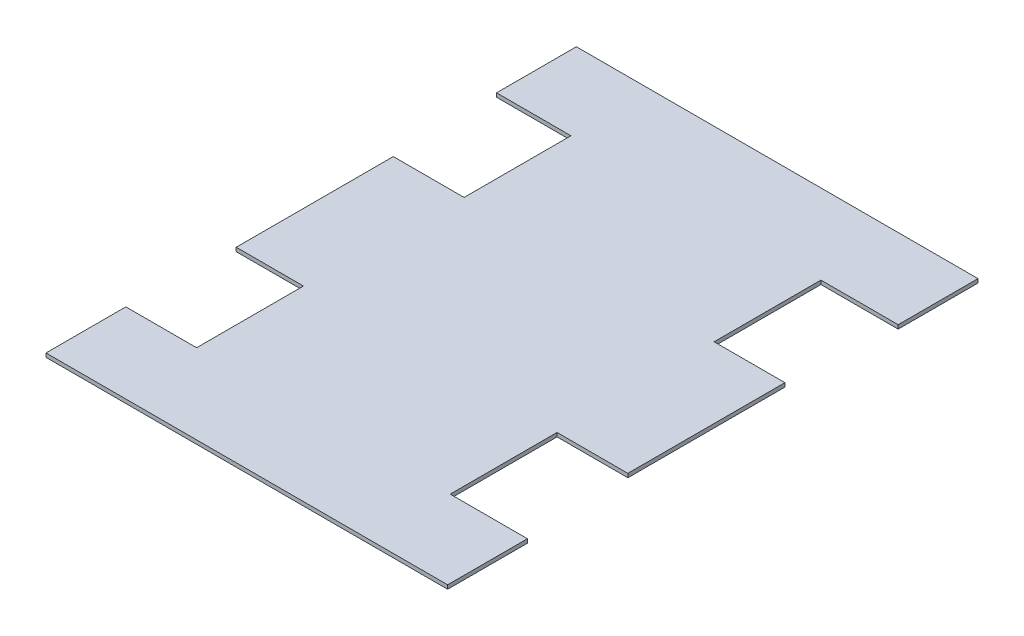
ISO-10303-21;
HEADER;
FILE_DESCRIPTION(('STEP AP214'),'2;1');
FILE_NAME('part.step','',(''),(''),'','','');
FILE_SCHEMA(('AUTOMOTIVE_DESIGN { 1 0 10303 214 1 1 1 1 }'));
ENDSEC;
DATA;
#1=APPLICATION_CONTEXT('core data for automotive mechanical design processes');
#2=APPLICATION_PROTOCOL_DEFINITION('international standard','automotive_design',2000,#1);
#3=PRODUCT_CONTEXT('',#1,'mechanical');
#4=PRODUCT('Part','Part','',(#3));
#5=PRODUCT_RELATED_PRODUCT_CATEGORY('part','',(#4));
#6=PRODUCT_DEFINITION_FORMATION('','',#4);
#7=PRODUCT_DEFINITION_CONTEXT('part definition',#1,'design');
#8=PRODUCT_DEFINITION('design','',#6,#7);
#9=PRODUCT_DEFINITION_SHAPE('','',#8);
#10=(LENGTH_UNIT() NAMED_UNIT(*) SI_UNIT(.MILLI.,.METRE.));
#11=(NAMED_UNIT(*) PLANE_ANGLE_UNIT() SI_UNIT($,.RADIAN.));
#12=(NAMED_UNIT(*) SI_UNIT($,.STERADIAN.) SOLID_ANGLE_UNIT());
#13=UNCERTAINTY_MEASURE_WITH_UNIT(LENGTH_MEASURE(1.E-05),#10,'distance_accuracy_value','');
#14=(GEOMETRIC_REPRESENTATION_CONTEXT(3) GLOBAL_UNCERTAINTY_ASSIGNED_CONTEXT((#13)) GLOBAL_UNIT_ASSIGNED_CONTEXT((#10,
#11,#12)) REPRESENTATION_CONTEXT('',''));
#15=CARTESIAN_POINT('',(0.,0.,0.));
#16=DIRECTION('',(0.,0.,1.));
#17=DIRECTION('',(1.,0.,0.));
#18=AXIS2_PLACEMENT_3D('',#15,#16,#17);
#19=CARTESIAN_POINT('',(-27.0247369323161,3.,-144.778970111384));
#20=DIRECTION('',(0.,0.,-1.));
#21=DIRECTION('',(-1.,0.,0.));
#22=AXIS2_PLACEMENT_3D('',#19,#20,#21);
#23=PLANE('',#22);
#24=DIRECTION('',(1.,0.,0.));
#25=VECTOR('',#24,1.);
#26=CARTESIAN_POINT('',(-27.0247369323161,0.,-144.778970111384));
#27=LINE('',#26,#25);
#28=CARTESIAN_POINT('',(-27.0247369323161,0.,-144.778970111384));
#29=VERTEX_POINT('',#28);
#30=CARTESIAN_POINT('',(30.7568580000845,0.,-144.778970111384));
#31=VERTEX_POINT('',#30);
#32=EDGE_CURVE('E200',#29,#31,#27,.T.);
#33=ORIENTED_EDGE('',*,*,#32,.T.);
#34=DIRECTION('',(0.,-1.,0.));
#35=VECTOR('',#34,1.);
#36=CARTESIAN_POINT('',(30.7568580000845,3.,-144.778970111384));
#37=LINE('',#36,#35);
#38=CARTESIAN_POINT('',(30.7568580000845,3.,-144.778970111384));
#39=VERTEX_POINT('',#38);
#40=EDGE_CURVE('E11',#39,#31,#37,.T.);
#41=ORIENTED_EDGE('',*,*,#40,.F.);
#42=DIRECTION('',(1.,0.,0.));
#43=VECTOR('',#42,1.);
#44=CARTESIAN_POINT('',(-27.0247369323161,3.,-144.778970111384));
#45=LINE('',#44,#43);
#46=CARTESIAN_POINT('',(-27.0247369323161,3.,-144.778970111384));
#47=VERTEX_POINT('',#46);
#48=EDGE_CURVE('E238',#47,#39,#45,.T.);
#49=ORIENTED_EDGE('',*,*,#48,.F.);
#50=DIRECTION('',(0.,-1.,0.));
#51=VECTOR('',#50,1.);
#52=CARTESIAN_POINT('',(-27.0247369323161,3.,-144.778970111384));
#53=LINE('',#52,#51);
#54=EDGE_CURVE('E196',#47,#29,#53,.T.);
#55=ORIENTED_EDGE('',*,*,#54,.T.);
#56=EDGE_LOOP('',(#33,#41,#49,#55));
#57=FACE_BOUND('',#56,.T.);
#58=ADVANCED_FACE('F32',(#57),#23,.F.);
#59=CARTESIAN_POINT('',(30.756858000085,3.,-61.778970111384));
#60=DIRECTION('',(1.,0.,0.));
#61=DIRECTION('',(0.,0.,-1.));
#62=AXIS2_PLACEMENT_3D('',#59,#60,#61);
#63=PLANE('',#62);
#64=DIRECTION('',(0.,0.,1.));
#65=VECTOR('',#64,1.);
#66=CARTESIAN_POINT('',(30.756858000085,0.,-61.778970111384));
#67=LINE('',#66,#65);
#68=CARTESIAN_POINT('',(30.756858000085,0.,-61.778970111384));
#69=VERTEX_POINT('',#68);
#70=EDGE_CURVE('E203',#31,#69,#67,.T.);
#71=ORIENTED_EDGE('',*,*,#70,.T.);
#72=DIRECTION('',(0.,-1.,0.));
#73=VECTOR('',#72,1.);
#74=CARTESIAN_POINT('',(30.756858000085,3.,-61.778970111384));
#75=LINE('',#74,#73);
#76=CARTESIAN_POINT('',(30.756858000085,3.,-61.778970111384));
#77=VERTEX_POINT('',#76);
#78=EDGE_CURVE('E40',#77,#69,#75,.T.);
#79=ORIENTED_EDGE('',*,*,#78,.F.);
#80=DIRECTION('',(0.,0.,1.));
#81=VECTOR('',#80,1.);
#82=CARTESIAN_POINT('',(30.756858000085,3.,-61.778970111384));
#83=LINE('',#82,#81);
#84=EDGE_CURVE('E127',#39,#77,#83,.T.);
#85=ORIENTED_EDGE('',*,*,#84,.F.);
#86=ORIENTED_EDGE('',*,*,#40,.T.);
#87=EDGE_LOOP('',(#71,#79,#85,#86));
#88=FACE_BOUND('',#87,.T.);
#89=ADVANCED_FACE('F356',(#88),#63,.F.);
#90=CARTESIAN_POINT('',(-24.243141999915,3.,-61.7789701113836));
#91=DIRECTION('',(0.,0.,1.));
#92=DIRECTION('',(1.,0.,0.));
#93=AXIS2_PLACEMENT_3D('',#90,#91,#92);
#94=PLANE('',#93);
#95=DIRECTION('',(-1.,0.,0.));
#96=VECTOR('',#95,1.);
#97=CARTESIAN_POINT('',(-24.243141999915,0.,-61.7789701113836));
#98=LINE('',#97,#96);
#99=CARTESIAN_POINT('',(-24.243141999915,0.,-61.7789701113836));
#100=VERTEX_POINT('',#99);
#101=EDGE_CURVE('E205',#69,#100,#98,.T.);
#102=ORIENTED_EDGE('',*,*,#101,.T.);
#103=DIRECTION('',(0.,-1.,0.));
#104=VECTOR('',#103,1.);
#105=CARTESIAN_POINT('',(-24.243141999915,3.,-61.7789701113836));
#106=LINE('',#105,#104);
#107=CARTESIAN_POINT('',(-24.243141999915,3.,-61.7789701113836));
#108=VERTEX_POINT('',#107);
#109=EDGE_CURVE('E281',#108,#100,#106,.T.);
#110=ORIENTED_EDGE('',*,*,#109,.F.);
#111=DIRECTION('',(-1.,0.,0.));
#112=VECTOR('',#111,1.);
#113=CARTESIAN_POINT('',(-24.243141999915,3.,-61.7789701113836));
#114=LINE('',#113,#112);
#115=EDGE_CURVE('E289',#77,#108,#114,.T.);
#116=ORIENTED_EDGE('',*,*,#115,.F.);
#117=ORIENTED_EDGE('',*,*,#78,.T.);
#118=EDGE_LOOP('',(#102,#110,#116,#117));
#119=FACE_BOUND('',#118,.T.);
#120=ADVANCED_FACE('F287',(#119),#94,.F.);
#121=CARTESIAN_POINT('',(-24.2431419999141,3.,60.2210298886164));
#122=DIRECTION('',(1.,0.,0.));
#123=DIRECTION('',(0.,0.,-1.));
#124=AXIS2_PLACEMENT_3D('',#121,#122,#123);
#125=PLANE('',#124);
#126=DIRECTION('',(0.,0.,1.));
#127=VECTOR('',#126,1.);
#128=CARTESIAN_POINT('',(-24.2431419999141,0.,60.2210298886164));
#129=LINE('',#128,#127);
#130=CARTESIAN_POINT('',(-24.2431419999141,0.,60.2210298886164));
#131=VERTEX_POINT('',#130);
#132=EDGE_CURVE('E207',#100,#131,#129,.T.);
#133=ORIENTED_EDGE('',*,*,#132,.T.);
#134=DIRECTION('',(0.,-1.,0.));
#135=VECTOR('',#134,1.);
#136=CARTESIAN_POINT('',(-24.2431419999141,3.,60.2210298886164));
#137=LINE('',#136,#135);
#138=CARTESIAN_POINT('',(-24.2431419999141,3.,60.2210298886164));
#139=VERTEX_POINT('',#138);
#140=EDGE_CURVE('E278',#139,#131,#137,.T.);
#141=ORIENTED_EDGE('',*,*,#140,.F.);
#142=DIRECTION('',(0.,0.,1.));
#143=VECTOR('',#142,1.);
#144=CARTESIAN_POINT('',(-24.2431419999141,3.,60.2210298886164));
#145=LINE('',#144,#143);
#146=EDGE_CURVE('E307',#108,#139,#145,.T.);
#147=ORIENTED_EDGE('',*,*,#146,.F.);
#148=ORIENTED_EDGE('',*,*,#109,.T.);
#149=EDGE_LOOP('',(#133,#141,#147,#148));
#150=FACE_BOUND('',#149,.T.);
#151=ADVANCED_FACE('F298',(#150),#125,.F.);
#152=CARTESIAN_POINT('',(-24.2431419999141,3.,60.2210298886164));
#153=DIRECTION('',(0.,0.,-1.));
#154=DIRECTION('',(-1.,0.,0.));
#155=AXIS2_PLACEMENT_3D('',#152,#153,#154);
#156=PLANE('',#155);
#157=DIRECTION('',(1.,0.,0.));
#158=VECTOR('',#157,1.);
#159=CARTESIAN_POINT('',(-24.2431419999141,0.,60.2210298886164));
#160=LINE('',#159,#158);
#161=CARTESIAN_POINT('',(27.9752630676854,0.,60.221029888616));
#162=VERTEX_POINT('',#161);
#163=EDGE_CURVE('E209',#131,#162,#160,.T.);
#164=ORIENTED_EDGE('',*,*,#163,.T.);
#165=DIRECTION('',(0.,-1.,0.));
#166=VECTOR('',#165,1.);
#167=CARTESIAN_POINT('',(27.9752630676854,3.,60.221029888616));
#168=LINE('',#167,#166);
#169=CARTESIAN_POINT('',(27.9752630676854,3.,60.221029888616));
#170=VERTEX_POINT('',#169);
#171=EDGE_CURVE('E275',#170,#162,#168,.T.);
#172=ORIENTED_EDGE('',*,*,#171,.F.);
#173=DIRECTION('',(1.,0.,0.));
#174=VECTOR('',#173,1.);
#175=CARTESIAN_POINT('',(-24.2431419999141,3.,60.2210298886164));
#176=LINE('',#175,#174);
#177=EDGE_CURVE('E304',#139,#170,#176,.T.);
#178=ORIENTED_EDGE('',*,*,#177,.F.);
#179=ORIENTED_EDGE('',*,*,#140,.T.);
#180=EDGE_LOOP('',(#164,#172,#178,#179));
#181=FACE_BOUND('',#180,.T.);
#182=ADVANCED_FACE('F302',(#181),#156,.F.);
#183=CARTESIAN_POINT('',(27.9752630676859,3.,143.221029888616));
#184=DIRECTION('',(1.,0.,0.));
#185=DIRECTION('',(0.,0.,-1.));
#186=AXIS2_PLACEMENT_3D('',#183,#184,#185);
#187=PLANE('',#186);
#188=DIRECTION('',(0.,0.,1.));
#189=VECTOR('',#188,1.);
#190=CARTESIAN_POINT('',(27.9752630676859,0.,143.221029888616));
#191=LINE('',#190,#189);
#192=CARTESIAN_POINT('',(27.9752630676859,0.,143.221029888616));
#193=VERTEX_POINT('',#192);
#194=EDGE_CURVE('E211',#162,#193,#191,.T.);
#195=ORIENTED_EDGE('',*,*,#194,.T.);
#196=DIRECTION('',(0.,-1.,0.));
#197=VECTOR('',#196,1.);
#198=CARTESIAN_POINT('',(27.9752630676859,3.,143.221029888616));
#199=LINE('',#198,#197);
#200=CARTESIAN_POINT('',(27.9752630676859,3.,143.221029888616));
#201=VERTEX_POINT('',#200);
#202=EDGE_CURVE('E272',#201,#193,#199,.T.);
#203=ORIENTED_EDGE('',*,*,#202,.F.);
#204=DIRECTION('',(0.,0.,1.));
#205=VECTOR('',#204,1.);
#206=CARTESIAN_POINT('',(27.9752630676859,3.,143.221029888616));
#207=LINE('',#206,#205);
#208=EDGE_CURVE('E306',#170,#201,#207,.T.);
#209=ORIENTED_EDGE('',*,*,#208,.F.);
#210=ORIENTED_EDGE('',*,*,#171,.T.);
#211=EDGE_LOOP('',(#195,#203,#209,#210));
#212=FACE_BOUND('',#211,.T.);
#213=ADVANCED_FACE('F369',(#212),#187,.F.);
#214=CARTESIAN_POINT('',(-27.0247369323141,3.,143.221029888616));
#215=DIRECTION('',(0.,0.,1.));
#216=DIRECTION('',(1.,0.,0.));
#217=AXIS2_PLACEMENT_3D('',#214,#215,#216);
#218=PLANE('',#217);
#219=DIRECTION('',(-1.,0.,0.));
#220=VECTOR('',#219,1.);
#221=CARTESIAN_POINT('',(-27.0247369323141,0.,143.221029888616));
#222=LINE('',#221,#220);
#223=CARTESIAN_POINT('',(-27.0247369323141,0.,143.221029888616));
#224=VERTEX_POINT('',#223);
#225=EDGE_CURVE('E213',#193,#224,#222,.T.);
#226=ORIENTED_EDGE('',*,*,#225,.T.);
#227=DIRECTION('',(0.,-1.,0.));
#228=VECTOR('',#227,1.);
#229=CARTESIAN_POINT('',(-27.0247369323141,3.,143.221029888616));
#230=LINE('',#229,#228);
#231=CARTESIAN_POINT('',(-27.0247369323141,3.,143.221029888616));
#232=VERTEX_POINT('',#231);
#233=EDGE_CURVE('E269',#232,#224,#230,.T.);
#234=ORIENTED_EDGE('',*,*,#233,.F.);
#235=DIRECTION('',(-1.,0.,0.));
#236=VECTOR('',#235,1.);
#237=CARTESIAN_POINT('',(-27.0247369323141,3.,143.221029888616));
#238=LINE('',#237,#236);
#239=EDGE_CURVE('E309',#201,#232,#238,.T.);
#240=ORIENTED_EDGE('',*,*,#239,.F.);
#241=ORIENTED_EDGE('',*,*,#202,.T.);
#242=EDGE_LOOP('',(#226,#234,#240,#241));
#243=FACE_BOUND('',#242,.T.);
#244=ADVANCED_FACE('F372',(#243),#218,.F.);
#245=CARTESIAN_POINT('',(-27.0247369323136,3.,205.221029888616));
#246=DIRECTION('',(1.,0.,0.));
#247=DIRECTION('',(0.,0.,-1.));
#248=AXIS2_PLACEMENT_3D('',#245,#246,#247);
#249=PLANE('',#248);
#250=DIRECTION('',(0.,0.,1.));
#251=VECTOR('',#250,1.);
#252=CARTESIAN_POINT('',(-27.0247369323136,0.,205.221029888616));
#253=LINE('',#252,#251);
#254=CARTESIAN_POINT('',(-27.0247369323136,0.,205.221029888616));
#255=VERTEX_POINT('',#254);
#256=EDGE_CURVE('E215',#224,#255,#253,.T.);
#257=ORIENTED_EDGE('',*,*,#256,.T.);
#258=DIRECTION('',(0.,-1.,0.));
#259=VECTOR('',#258,1.);
#260=CARTESIAN_POINT('',(-27.0247369323136,3.,205.221029888616));
#261=LINE('',#260,#259);
#262=CARTESIAN_POINT('',(-27.0247369323136,3.,205.221029888616));
#263=VERTEX_POINT('',#262);
#264=EDGE_CURVE('E266',#263,#255,#261,.T.);
#265=ORIENTED_EDGE('',*,*,#264,.F.);
#266=DIRECTION('',(0.,0.,1.));
#267=VECTOR('',#266,1.);
#268=CARTESIAN_POINT('',(-27.0247369323136,3.,205.221029888616));
#269=LINE('',#268,#267);
#270=EDGE_CURVE('E315',#232,#263,#269,.T.);
#271=ORIENTED_EDGE('',*,*,#270,.F.);
#272=ORIENTED_EDGE('',*,*,#233,.T.);
#273=EDGE_LOOP('',(#257,#265,#271,#272));
#274=FACE_BOUND('',#273,.T.);
#275=ADVANCED_FACE('F376',(#274),#249,.F.);
#276=CARTESIAN_POINT('',(-27.0247369323136,3.,205.221029888616));
#277=DIRECTION('',(0.,0.,-1.));
#278=DIRECTION('',(-1.,0.,0.));
#279=AXIS2_PLACEMENT_3D('',#276,#277,#278);
#280=PLANE('',#279);
#281=DIRECTION('',(1.,0.,0.));
#282=VECTOR('',#281,1.);
#283=CARTESIAN_POINT('',(-27.0247369323136,0.,205.221029888616));
#284=LINE('',#283,#282);
#285=CARTESIAN_POINT('',(284.975263067686,0.,205.221029888614));
#286=VERTEX_POINT('',#285);
#287=EDGE_CURVE('E217',#255,#286,#284,.T.);
#288=ORIENTED_EDGE('',*,*,#287,.T.);
#289=DIRECTION('',(0.,-1.,0.));
#290=VECTOR('',#289,1.);
#291=CARTESIAN_POINT('',(284.975263067686,3.,205.221029888614));
#292=LINE('',#291,#290);
#293=CARTESIAN_POINT('',(284.975263067686,3.,205.221029888614));
#294=VERTEX_POINT('',#293);
#295=EDGE_CURVE('E263',#294,#286,#292,.T.);
#296=ORIENTED_EDGE('',*,*,#295,.F.);
#297=DIRECTION('',(1.,0.,0.));
#298=VECTOR('',#297,1.);
#299=CARTESIAN_POINT('',(-27.0247369323136,3.,205.221029888616));
#300=LINE('',#299,#298);
#301=EDGE_CURVE('E317',#263,#294,#300,.T.);
#302=ORIENTED_EDGE('',*,*,#301,.F.);
#303=ORIENTED_EDGE('',*,*,#264,.T.);
#304=EDGE_LOOP('',(#288,#296,#302,#303));
#305=FACE_BOUND('',#304,.T.);
#306=ADVANCED_FACE('F380',(#305),#280,.F.);
#307=CARTESIAN_POINT('',(284.975263067686,3.,205.221029888614));
#308=DIRECTION('',(-1.,0.,0.));
#309=DIRECTION('',(0.,0.,1.));
#310=AXIS2_PLACEMENT_3D('',#307,#308,#309);
#311=PLANE('',#310);
#312=DIRECTION('',(0.,0.,-1.));
#313=VECTOR('',#312,1.);
#314=CARTESIAN_POINT('',(284.975263067686,0.,205.221029888614));
#315=LINE('',#314,#313);
#316=CARTESIAN_POINT('',(284.975263067686,0.,143.221029888614));
#317=VERTEX_POINT('',#316);
#318=EDGE_CURVE('E219',#286,#317,#315,.T.);
#319=ORIENTED_EDGE('',*,*,#318,.T.);
#320=DIRECTION('',(0.,-1.,0.));
#321=VECTOR('',#320,1.);
#322=CARTESIAN_POINT('',(284.975263067686,3.,143.221029888614));
#323=LINE('',#322,#321);
#324=CARTESIAN_POINT('',(284.975263067686,3.,143.221029888614));
#325=VERTEX_POINT('',#324);
#326=EDGE_CURVE('E260',#325,#317,#323,.T.);
#327=ORIENTED_EDGE('',*,*,#326,.F.);
#328=DIRECTION('',(0.,0.,-1.));
#329=VECTOR('',#328,1.);
#330=CARTESIAN_POINT('',(284.975263067686,3.,205.221029888614));
#331=LINE('',#330,#329);
#332=EDGE_CURVE('E319',#294,#325,#331,.T.);
#333=ORIENTED_EDGE('',*,*,#332,.F.);
#334=ORIENTED_EDGE('',*,*,#295,.T.);
#335=EDGE_LOOP('',(#319,#327,#333,#334));
#336=FACE_BOUND('',#335,.T.);
#337=ADVANCED_FACE('F384',(#336),#311,.F.);
#338=CARTESIAN_POINT('',(224.97170265191,3.,143.221029888615));
#339=DIRECTION('',(0.,0.,1.));
#340=DIRECTION('',(1.,0.,0.));
#341=AXIS2_PLACEMENT_3D('',#338,#339,#340);
#342=PLANE('',#341);
#343=DIRECTION('',(-1.,0.,0.));
#344=VECTOR('',#343,1.);
#345=CARTESIAN_POINT('',(224.97170265191,0.,143.221029888615));
#346=LINE('',#345,#344);
#347=CARTESIAN_POINT('',(224.97170265191,0.,143.221029888615));
#348=VERTEX_POINT('',#347);
#349=EDGE_CURVE('E221',#317,#348,#346,.T.);
#350=ORIENTED_EDGE('',*,*,#349,.T.);
#351=DIRECTION('',(0.,-1.,0.));
#352=VECTOR('',#351,1.);
#353=CARTESIAN_POINT('',(224.97170265191,3.,143.221029888615));
#354=LINE('',#353,#352);
#355=CARTESIAN_POINT('',(224.97170265191,3.,143.221029888615));
#356=VERTEX_POINT('',#355);
#357=EDGE_CURVE('E257',#356,#348,#354,.T.);
#358=ORIENTED_EDGE('',*,*,#357,.F.);
#359=DIRECTION('',(-1.,0.,0.));
#360=VECTOR('',#359,1.);
#361=CARTESIAN_POINT('',(224.97170265191,3.,143.221029888615));
#362=LINE('',#361,#360);
#363=EDGE_CURVE('E321',#325,#356,#362,.T.);
#364=ORIENTED_EDGE('',*,*,#363,.F.);
#365=ORIENTED_EDGE('',*,*,#326,.T.);
#366=EDGE_LOOP('',(#350,#358,#364,#365));
#367=FACE_BOUND('',#366,.T.);
#368=ADVANCED_FACE('F388',(#367),#342,.F.);
#369=CARTESIAN_POINT('',(224.97170265191,3.,143.221029888615));
#370=DIRECTION('',(-1.,0.,0.));
#371=DIRECTION('',(0.,0.,1.));
#372=AXIS2_PLACEMENT_3D('',#369,#370,#371);
#373=PLANE('',#372);
#374=DIRECTION('',(0.,0.,-1.));
#375=VECTOR('',#374,1.);
#376=CARTESIAN_POINT('',(224.97170265191,0.,143.221029888615));
#377=LINE('',#376,#375);
#378=CARTESIAN_POINT('',(224.97170265191,0.,60.2210298886146));
#379=VERTEX_POINT('',#378);
#380=EDGE_CURVE('E223',#348,#379,#377,.T.);
#381=ORIENTED_EDGE('',*,*,#380,.T.);
#382=DIRECTION('',(0.,-1.,0.));
#383=VECTOR('',#382,1.);
#384=CARTESIAN_POINT('',(224.97170265191,3.,60.2210298886146));
#385=LINE('',#384,#383);
#386=CARTESIAN_POINT('',(224.97170265191,3.,60.2210298886146));
#387=VERTEX_POINT('',#386);
#388=EDGE_CURVE('E254',#387,#379,#385,.T.);
#389=ORIENTED_EDGE('',*,*,#388,.F.);
#390=DIRECTION('',(0.,0.,-1.));
#391=VECTOR('',#390,1.);
#392=CARTESIAN_POINT('',(224.97170265191,3.,143.221029888615));
#393=LINE('',#392,#391);
#394=EDGE_CURVE('E323',#356,#387,#393,.T.);
#395=ORIENTED_EDGE('',*,*,#394,.F.);
#396=ORIENTED_EDGE('',*,*,#357,.T.);
#397=EDGE_LOOP('',(#381,#389,#395,#396));
#398=FACE_BOUND('',#397,.T.);
#399=ADVANCED_FACE('F392',(#398),#373,.F.);
#400=CARTESIAN_POINT('',(224.97170265191,3.,60.2210298886146));
#401=DIRECTION('',(0.,0.,-1.));
#402=DIRECTION('',(-1.,0.,0.));
#403=AXIS2_PLACEMENT_3D('',#400,#401,#402);
#404=PLANE('',#403);
#405=DIRECTION('',(1.,0.,0.));
#406=VECTOR('',#405,1.);
#407=CARTESIAN_POINT('',(224.97170265191,0.,60.2210298886146));
#408=LINE('',#407,#406);
#409=CARTESIAN_POINT('',(279.97170265191,0.,60.2210298886143));
#410=VERTEX_POINT('',#409);
#411=EDGE_CURVE('E225',#379,#410,#408,.T.);
#412=ORIENTED_EDGE('',*,*,#411,.T.);
#413=DIRECTION('',(0.,-1.,0.));
#414=VECTOR('',#413,1.);
#415=CARTESIAN_POINT('',(279.97170265191,3.,60.2210298886143));
#416=LINE('',#415,#414);
#417=CARTESIAN_POINT('',(279.97170265191,3.,60.2210298886143));
#418=VERTEX_POINT('',#417);
#419=EDGE_CURVE('E251',#418,#410,#416,.T.);
#420=ORIENTED_EDGE('',*,*,#419,.F.);
#421=DIRECTION('',(1.,0.,0.));
#422=VECTOR('',#421,1.);
#423=CARTESIAN_POINT('',(224.97170265191,3.,60.2210298886146));
#424=LINE('',#423,#422);
#425=EDGE_CURVE('E325',#387,#418,#424,.T.);
#426=ORIENTED_EDGE('',*,*,#425,.F.);
#427=ORIENTED_EDGE('',*,*,#388,.T.);
#428=EDGE_LOOP('',(#412,#420,#426,#427));
#429=FACE_BOUND('',#428,.T.);
#430=ADVANCED_FACE('F396',(#429),#404,.F.);
#431=CARTESIAN_POINT('',(279.97170265191,3.,60.2210298886143));
#432=DIRECTION('',(-1.,0.,0.));
#433=DIRECTION('',(0.,0.,1.));
#434=AXIS2_PLACEMENT_3D('',#431,#432,#433);
#435=PLANE('',#434);
#436=DIRECTION('',(0.,0.,-1.));
#437=VECTOR('',#436,1.);
#438=CARTESIAN_POINT('',(279.97170265191,0.,60.2210298886143));
#439=LINE('',#438,#437);
#440=CARTESIAN_POINT('',(279.971702651909,0.,-61.7789701113857));
#441=VERTEX_POINT('',#440);
#442=EDGE_CURVE('E227',#410,#441,#439,.T.);
#443=ORIENTED_EDGE('',*,*,#442,.T.);
#444=DIRECTION('',(0.,-1.,0.));
#445=VECTOR('',#444,1.);
#446=CARTESIAN_POINT('',(279.971702651909,3.,-61.7789701113857));
#447=LINE('',#446,#445);
#448=CARTESIAN_POINT('',(279.971702651909,3.,-61.7789701113857));
#449=VERTEX_POINT('',#448);
#450=EDGE_CURVE('E248',#449,#441,#447,.T.);
#451=ORIENTED_EDGE('',*,*,#450,.F.);
#452=DIRECTION('',(0.,0.,-1.));
#453=VECTOR('',#452,1.);
#454=CARTESIAN_POINT('',(279.97170265191,3.,60.2210298886143));
#455=LINE('',#454,#453);
#456=EDGE_CURVE('E327',#418,#449,#455,.T.);
#457=ORIENTED_EDGE('',*,*,#456,.F.);
#458=ORIENTED_EDGE('',*,*,#419,.T.);
#459=EDGE_LOOP('',(#443,#451,#457,#458));
#460=FACE_BOUND('',#459,.T.);
#461=ADVANCED_FACE('F400',(#460),#435,.F.);
#462=CARTESIAN_POINT('',(224.971702651909,3.,-61.7789701113854));
#463=DIRECTION('',(0.,0.,1.));
#464=DIRECTION('',(1.,0.,0.));
#465=AXIS2_PLACEMENT_3D('',#462,#463,#464);
#466=PLANE('',#465);
#467=DIRECTION('',(-1.,0.,0.));
#468=VECTOR('',#467,1.);
#469=CARTESIAN_POINT('',(224.971702651909,0.,-61.7789701113854));
#470=LINE('',#469,#468);
#471=CARTESIAN_POINT('',(224.971702651909,0.,-61.7789701113854));
#472=VERTEX_POINT('',#471);
#473=EDGE_CURVE('E229',#441,#472,#470,.T.);
#474=ORIENTED_EDGE('',*,*,#473,.T.);
#475=DIRECTION('',(0.,-1.,0.));
#476=VECTOR('',#475,1.);
#477=CARTESIAN_POINT('',(224.971702651909,3.,-61.7789701113854));
#478=LINE('',#477,#476);
#479=CARTESIAN_POINT('',(224.971702651909,3.,-61.7789701113854));
#480=VERTEX_POINT('',#479);
#481=EDGE_CURVE('E245',#480,#472,#478,.T.);
#482=ORIENTED_EDGE('',*,*,#481,.F.);
#483=DIRECTION('',(-1.,0.,0.));
#484=VECTOR('',#483,1.);
#485=CARTESIAN_POINT('',(224.971702651909,3.,-61.7789701113854));
#486=LINE('',#485,#484);
#487=EDGE_CURVE('E329',#449,#480,#486,.T.);
#488=ORIENTED_EDGE('',*,*,#487,.F.);
#489=ORIENTED_EDGE('',*,*,#450,.T.);
#490=EDGE_LOOP('',(#474,#482,#488,#489));
#491=FACE_BOUND('',#490,.T.);
#492=ADVANCED_FACE('F404',(#491),#466,.F.);
#493=CARTESIAN_POINT('',(224.971702651909,3.,-61.7789701113854));
#494=DIRECTION('',(-1.,0.,0.));
#495=DIRECTION('',(0.,0.,1.));
#496=AXIS2_PLACEMENT_3D('',#493,#494,#495);
#497=PLANE('',#496);
#498=DIRECTION('',(0.,0.,-1.));
#499=VECTOR('',#498,1.);
#500=CARTESIAN_POINT('',(224.971702651909,0.,-61.7789701113854));
#501=LINE('',#500,#499);
#502=CARTESIAN_POINT('',(224.971702651908,0.,-144.778970111385));
#503=VERTEX_POINT('',#502);
#504=EDGE_CURVE('E231',#472,#503,#501,.T.);
#505=ORIENTED_EDGE('',*,*,#504,.T.);
#506=DIRECTION('',(0.,-1.,0.));
#507=VECTOR('',#506,1.);
#508=CARTESIAN_POINT('',(224.971702651908,3.,-144.778970111385));
#509=LINE('',#508,#507);
#510=CARTESIAN_POINT('',(224.971702651908,3.,-144.778970111385));
#511=VERTEX_POINT('',#510);
#512=EDGE_CURVE('E242',#511,#503,#509,.T.);
#513=ORIENTED_EDGE('',*,*,#512,.F.);
#514=DIRECTION('',(0.,0.,-1.));
#515=VECTOR('',#514,1.);
#516=CARTESIAN_POINT('',(224.971702651909,3.,-61.7789701113854));
#517=LINE('',#516,#515);
#518=EDGE_CURVE('E331',#480,#511,#517,.T.);
#519=ORIENTED_EDGE('',*,*,#518,.F.);
#520=ORIENTED_EDGE('',*,*,#481,.T.);
#521=EDGE_LOOP('',(#505,#513,#519,#520));
#522=FACE_BOUND('',#521,.T.);
#523=ADVANCED_FACE('F337',(#522),#497,.F.);
#524=CARTESIAN_POINT('',(224.971702651908,3.,-144.778970111385));
#525=DIRECTION('',(0.,0.,-1.));
#526=DIRECTION('',(-1.,0.,0.));
#527=AXIS2_PLACEMENT_3D('',#524,#525,#526);
#528=PLANE('',#527);
#529=DIRECTION('',(1.,0.,0.));
#530=VECTOR('',#529,1.);
#531=CARTESIAN_POINT('',(224.971702651908,0.,-144.778970111385));
#532=LINE('',#531,#530);
#533=CARTESIAN_POINT('',(284.975263067684,0.,-144.778970111386));
#534=VERTEX_POINT('',#533);
#535=EDGE_CURVE('E233',#503,#534,#532,.T.);
#536=ORIENTED_EDGE('',*,*,#535,.T.);
#537=DIRECTION('',(0.,-1.,0.));
#538=VECTOR('',#537,1.);
#539=CARTESIAN_POINT('',(284.975263067684,3.,-144.778970111386));
#540=LINE('',#539,#538);
#541=CARTESIAN_POINT('',(284.975263067684,3.,-144.778970111386));
#542=VERTEX_POINT('',#541);
#543=EDGE_CURVE('E191',#542,#534,#540,.T.);
#544=ORIENTED_EDGE('',*,*,#543,.F.);
#545=DIRECTION('',(1.,0.,0.));
#546=VECTOR('',#545,1.);
#547=CARTESIAN_POINT('',(224.971702651908,3.,-144.778970111385));
#548=LINE('',#547,#546);
#549=EDGE_CURVE('E182',#511,#542,#548,.T.);
#550=ORIENTED_EDGE('',*,*,#549,.F.);
#551=ORIENTED_EDGE('',*,*,#512,.T.);
#552=EDGE_LOOP('',(#536,#544,#550,#551));
#553=FACE_BOUND('',#552,.T.);
#554=ADVANCED_FACE('F341',(#553),#528,.F.);
#555=CARTESIAN_POINT('',(284.975263067684,3.,-144.778970111386));
#556=DIRECTION('',(-1.,0.,0.));
#557=DIRECTION('',(0.,0.,1.));
#558=AXIS2_PLACEMENT_3D('',#555,#556,#557);
#559=PLANE('',#558);
#560=DIRECTION('',(0.,0.,-1.));
#561=VECTOR('',#560,1.);
#562=CARTESIAN_POINT('',(284.975263067684,0.,-144.778970111386));
#563=LINE('',#562,#561);
#564=CARTESIAN_POINT('',(284.975263067683,0.,-206.778970111386));
#565=VERTEX_POINT('',#564);
#566=EDGE_CURVE('E190',#534,#565,#563,.T.);
#567=ORIENTED_EDGE('',*,*,#566,.T.);
#568=DIRECTION('',(0.,-1.,0.));
#569=VECTOR('',#568,1.);
#570=CARTESIAN_POINT('',(284.975263067683,3.,-206.778970111386));
#571=LINE('',#570,#569);
#572=CARTESIAN_POINT('',(284.975263067683,3.,-206.778970111386));
#573=VERTEX_POINT('',#572);
#574=EDGE_CURVE('E187',#573,#565,#571,.T.);
#575=ORIENTED_EDGE('',*,*,#574,.F.);
#576=DIRECTION('',(0.,0.,-1.));
#577=VECTOR('',#576,1.);
#578=CARTESIAN_POINT('',(284.975263067684,3.,-144.778970111386));
#579=LINE('',#578,#577);
#580=EDGE_CURVE('E176',#542,#573,#579,.T.);
#581=ORIENTED_EDGE('',*,*,#580,.F.);
#582=ORIENTED_EDGE('',*,*,#543,.T.);
#583=EDGE_LOOP('',(#567,#575,#581,#582));
#584=FACE_BOUND('',#583,.T.);
#585=ADVANCED_FACE('F188',(#584),#559,.F.);
#586=CARTESIAN_POINT('',(-27.0247369323165,3.,-206.778970111384));
#587=DIRECTION('',(0.,0.,1.));
#588=DIRECTION('',(1.,0.,0.));
#589=AXIS2_PLACEMENT_3D('',#586,#587,#588);
#590=PLANE('',#589);
#591=DIRECTION('',(-1.,0.,0.));
#592=VECTOR('',#591,1.);
#593=CARTESIAN_POINT('',(-27.0247369323165,0.,-206.778970111384));
#594=LINE('',#593,#592);
#595=CARTESIAN_POINT('',(-27.0247369323165,0.,-206.778970111384));
#596=VERTEX_POINT('',#595);
#597=EDGE_CURVE('E113',#565,#596,#594,.T.);
#598=ORIENTED_EDGE('',*,*,#597,.T.);
#599=DIRECTION('',(0.,-1.,0.));
#600=VECTOR('',#599,1.);
#601=CARTESIAN_POINT('',(-27.0247369323165,3.,-206.778970111384));
#602=LINE('',#601,#600);
#603=CARTESIAN_POINT('',(-27.0247369323165,3.,-206.778970111384));
#604=VERTEX_POINT('',#603);
#605=EDGE_CURVE('E192',#604,#596,#602,.T.);
#606=ORIENTED_EDGE('',*,*,#605,.F.);
#607=DIRECTION('',(-1.,0.,0.));
#608=VECTOR('',#607,1.);
#609=CARTESIAN_POINT('',(-27.0247369323165,3.,-206.778970111384));
#610=LINE('',#609,#608);
#611=EDGE_CURVE('E180',#573,#604,#610,.T.);
#612=ORIENTED_EDGE('',*,*,#611,.F.);
#613=ORIENTED_EDGE('',*,*,#574,.T.);
#614=EDGE_LOOP('',(#598,#606,#612,#613));
#615=FACE_BOUND('',#614,.T.);
#616=ADVANCED_FACE('F194',(#615),#590,.F.);
#617=CARTESIAN_POINT('',(-27.0247369323161,3.,-144.778970111384));
#618=DIRECTION('',(1.,0.,0.));
#619=DIRECTION('',(0.,0.,-1.));
#620=AXIS2_PLACEMENT_3D('',#617,#618,#619);
#621=PLANE('',#620);
#622=DIRECTION('',(0.,0.,1.));
#623=VECTOR('',#622,1.);
#624=CARTESIAN_POINT('',(-27.0247369323161,0.,-144.778970111384));
#625=LINE('',#624,#623);
#626=EDGE_CURVE('E119',#596,#29,#625,.T.);
#627=ORIENTED_EDGE('',*,*,#626,.T.);
#628=ORIENTED_EDGE('',*,*,#54,.F.);
#629=DIRECTION('',(0.,0.,1.));
#630=VECTOR('',#629,1.);
#631=CARTESIAN_POINT('',(-27.0247369323161,3.,-144.778970111384));
#632=LINE('',#631,#630);
#633=EDGE_CURVE('E48',#604,#47,#632,.T.);
#634=ORIENTED_EDGE('',*,*,#633,.F.);
#635=ORIENTED_EDGE('',*,*,#605,.T.);
#636=EDGE_LOOP('',(#627,#628,#634,#635));
#637=FACE_BOUND('',#636,.T.);
#638=ADVANCED_FACE('F345',(#637),#621,.F.);
#639=CARTESIAN_POINT('',(0.,3.,0.));
#640=DIRECTION('',(0.,1.,0.));
#641=DIRECTION('',(0.,0.,1.));
#642=AXIS2_PLACEMENT_3D('',#639,#640,#641);
#643=PLANE('',#642);
#644=ORIENTED_EDGE('',*,*,#48,.T.);
#645=ORIENTED_EDGE('',*,*,#84,.T.);
#646=ORIENTED_EDGE('',*,*,#115,.T.);
#647=ORIENTED_EDGE('',*,*,#146,.T.);
#648=ORIENTED_EDGE('',*,*,#177,.T.);
#649=ORIENTED_EDGE('',*,*,#208,.T.);
#650=ORIENTED_EDGE('',*,*,#239,.T.);
#651=ORIENTED_EDGE('',*,*,#270,.T.);
#652=ORIENTED_EDGE('',*,*,#301,.T.);
#653=ORIENTED_EDGE('',*,*,#332,.T.);
#654=ORIENTED_EDGE('',*,*,#363,.T.);
#655=ORIENTED_EDGE('',*,*,#394,.T.);
#656=ORIENTED_EDGE('',*,*,#425,.T.);
#657=ORIENTED_EDGE('',*,*,#456,.T.);
#658=ORIENTED_EDGE('',*,*,#487,.T.);
#659=ORIENTED_EDGE('',*,*,#518,.T.);
#660=ORIENTED_EDGE('',*,*,#549,.T.);
#661=ORIENTED_EDGE('',*,*,#580,.T.);
#662=ORIENTED_EDGE('',*,*,#611,.T.);
#663=ORIENTED_EDGE('',*,*,#633,.T.);
#664=EDGE_LOOP('',(#644,#645,#646,#647,#648,#649,#650,#651,#652,#653,#654,#655,#656,#657,#658,
#659,#660,#661,#662,#663));
#665=FACE_BOUND('',#664,.T.);
#666=ADVANCED_FACE('F178',(#665),#643,.T.);
#667=CARTESIAN_POINT('',(0.,0.,0.));
#668=DIRECTION('',(0.,1.,0.));
#669=DIRECTION('',(0.,0.,1.));
#670=AXIS2_PLACEMENT_3D('',#667,#668,#669);
#671=PLANE('',#670);
#672=ORIENTED_EDGE('',*,*,#32,.F.);
#673=ORIENTED_EDGE('',*,*,#626,.F.);
#674=ORIENTED_EDGE('',*,*,#597,.F.);
#675=ORIENTED_EDGE('',*,*,#566,.F.);
#676=ORIENTED_EDGE('',*,*,#535,.F.);
#677=ORIENTED_EDGE('',*,*,#504,.F.);
#678=ORIENTED_EDGE('',*,*,#473,.F.);
#679=ORIENTED_EDGE('',*,*,#442,.F.);
#680=ORIENTED_EDGE('',*,*,#411,.F.);
#681=ORIENTED_EDGE('',*,*,#380,.F.);
#682=ORIENTED_EDGE('',*,*,#349,.F.);
#683=ORIENTED_EDGE('',*,*,#318,.F.);
#684=ORIENTED_EDGE('',*,*,#287,.F.);
#685=ORIENTED_EDGE('',*,*,#256,.F.);
#686=ORIENTED_EDGE('',*,*,#225,.F.);
#687=ORIENTED_EDGE('',*,*,#194,.F.);
#688=ORIENTED_EDGE('',*,*,#163,.F.);
#689=ORIENTED_EDGE('',*,*,#132,.F.);
#690=ORIENTED_EDGE('',*,*,#101,.F.);
#691=ORIENTED_EDGE('',*,*,#70,.F.);
#692=EDGE_LOOP('',(#672,#673,#674,#675,#676,#677,#678,#679,#680,#681,#682,#683,#684,#685,#686,
#687,#688,#689,#690,#691));
#693=FACE_BOUND('',#692,.T.);
#694=ADVANCED_FACE('F293',(#693),#671,.F.);
#695=CLOSED_SHELL('',(#58,#89,#120,#151,#182,#213,#244,#275,#306,#337,#368,#399,#430,#461,#492,
#523,#554,#585,#616,#638,#666,#694));
#696=MANIFOLD_SOLID_BREP('B2',#695);
#697=ADVANCED_BREP_SHAPE_REPRESENTATION('',(#18,#696),#14);
#698=SHAPE_DEFINITION_REPRESENTATION(#9,#697);
ENDSEC;
END-ISO-10303-21;
